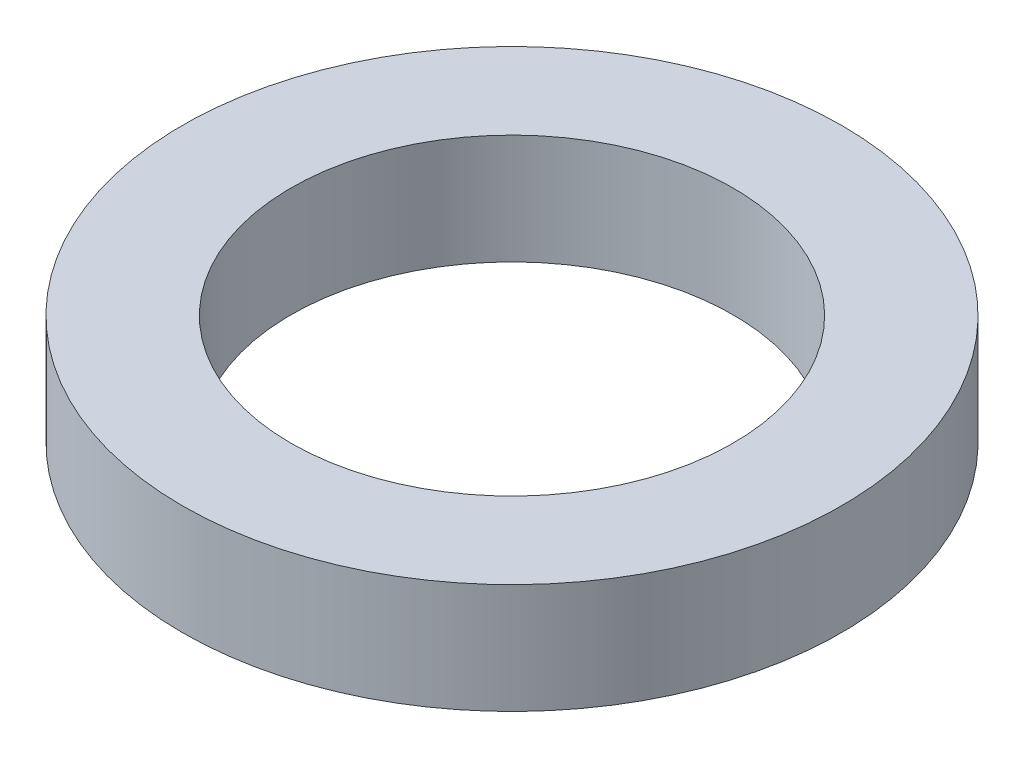
ISO-10303-21;
HEADER;
FILE_DESCRIPTION(('STEP AP214'),'2;1');
FILE_NAME('part.step','',(''),(''),'','','');
FILE_SCHEMA(('AUTOMOTIVE_DESIGN { 1 0 10303 214 1 1 1 1 }'));
ENDSEC;
DATA;
#1=APPLICATION_CONTEXT('core data for automotive mechanical design processes');
#2=APPLICATION_PROTOCOL_DEFINITION('international standard','automotive_design',2000,#1);
#3=PRODUCT_CONTEXT('',#1,'mechanical');
#4=PRODUCT('Part','Part','',(#3));
#5=PRODUCT_RELATED_PRODUCT_CATEGORY('part','',(#4));
#6=PRODUCT_DEFINITION_FORMATION('','',#4);
#7=PRODUCT_DEFINITION_CONTEXT('part definition',#1,'design');
#8=PRODUCT_DEFINITION('design','',#6,#7);
#9=PRODUCT_DEFINITION_SHAPE('','',#8);
#10=(LENGTH_UNIT() NAMED_UNIT(*) SI_UNIT(.MILLI.,.METRE.));
#11=(NAMED_UNIT(*) PLANE_ANGLE_UNIT() SI_UNIT($,.RADIAN.));
#12=(NAMED_UNIT(*) SI_UNIT($,.STERADIAN.) SOLID_ANGLE_UNIT());
#13=UNCERTAINTY_MEASURE_WITH_UNIT(LENGTH_MEASURE(1.E-05),#10,'distance_accuracy_value','');
#14=(GEOMETRIC_REPRESENTATION_CONTEXT(3) GLOBAL_UNCERTAINTY_ASSIGNED_CONTEXT((#13)) GLOBAL_UNIT_ASSIGNED_CONTEXT((#10,
#11,#12)) REPRESENTATION_CONTEXT('',''));
#15=CARTESIAN_POINT('',(0.,0.,0.));
#16=DIRECTION('',(0.,0.,1.));
#17=DIRECTION('',(1.,0.,0.));
#18=AXIS2_PLACEMENT_3D('',#15,#16,#17);
#19=CARTESIAN_POINT('',(0.,2.,0.));
#20=DIRECTION('',(0.,1.,0.));
#21=DIRECTION('',(0.,0.,1.));
#22=AXIS2_PLACEMENT_3D('',#19,#20,#21);
#23=PLANE('',#22);
#24=CARTESIAN_POINT('',(0.,2.,0.));
#25=DIRECTION('',(0.,1.,0.));
#26=DIRECTION('',(0.,0.,1.));
#27=AXIS2_PLACEMENT_3D('',#24,#25,#26);
#28=CIRCLE('',#27,6.);
#29=CARTESIAN_POINT('',(0.,2.,6.));
#30=VERTEX_POINT('',#29);
#31=EDGE_CURVE('E10',#30,#30,#28,.T.);
#32=ORIENTED_EDGE('',*,*,#31,.T.);
#33=EDGE_LOOP('',(#32));
#34=FACE_BOUND('',#33,.T.);
#35=CARTESIAN_POINT('',(0.,2.,0.));
#36=DIRECTION('',(0.,1.,0.));
#37=DIRECTION('',(0.,0.,1.));
#38=AXIS2_PLACEMENT_3D('',#35,#36,#37);
#39=CIRCLE('',#38,4.025);
#40=CARTESIAN_POINT('',(0.,2.,4.025));
#41=VERTEX_POINT('',#40);
#42=EDGE_CURVE('E56',#41,#41,#39,.T.);
#43=ORIENTED_EDGE('',*,*,#42,.F.);
#44=EDGE_LOOP('',(#43));
#45=FACE_BOUND('',#44,.T.);
#46=ADVANCED_FACE('F43',(#34,#45),#23,.T.);
#47=CARTESIAN_POINT('',(0.,0.,0.));
#48=DIRECTION('',(0.,1.,0.));
#49=DIRECTION('',(0.,0.,1.));
#50=AXIS2_PLACEMENT_3D('',#47,#48,#49);
#51=PLANE('',#50);
#52=CARTESIAN_POINT('',(0.,0.,0.));
#53=DIRECTION('',(0.,1.,0.));
#54=DIRECTION('',(0.,0.,1.));
#55=AXIS2_PLACEMENT_3D('',#52,#53,#54);
#56=CIRCLE('',#55,6.);
#57=CARTESIAN_POINT('',(0.,0.,6.));
#58=VERTEX_POINT('',#57);
#59=EDGE_CURVE('E47',#58,#58,#56,.T.);
#60=ORIENTED_EDGE('',*,*,#59,.F.);
#61=EDGE_LOOP('',(#60));
#62=FACE_BOUND('',#61,.T.);
#63=CARTESIAN_POINT('',(0.,0.,0.));
#64=DIRECTION('',(0.,1.,0.));
#65=DIRECTION('',(0.,0.,1.));
#66=AXIS2_PLACEMENT_3D('',#63,#64,#65);
#67=CIRCLE('',#66,4.025);
#68=CARTESIAN_POINT('',(0.,0.,4.025));
#69=VERTEX_POINT('',#68);
#70=EDGE_CURVE('E58',#69,#69,#67,.T.);
#71=ORIENTED_EDGE('',*,*,#70,.T.);
#72=EDGE_LOOP('',(#71));
#73=FACE_BOUND('',#72,.T.);
#74=ADVANCED_FACE('F70',(#62,#73),#51,.F.);
#75=CARTESIAN_POINT('',(0.,2.,0.));
#76=DIRECTION('',(0.,-1.,0.));
#77=DIRECTION('',(0.,0.,-1.));
#78=AXIS2_PLACEMENT_3D('',#75,#76,#77);
#79=CYLINDRICAL_SURFACE('',#78,6.);
#80=ORIENTED_EDGE('',*,*,#31,.F.);
#81=EDGE_LOOP('',(#80));
#82=FACE_BOUND('',#81,.T.);
#83=ORIENTED_EDGE('',*,*,#59,.T.);
#84=EDGE_LOOP('',(#83));
#85=FACE_BOUND('',#84,.T.);
#86=ADVANCED_FACE('F45',(#82,#85),#79,.T.);
#87=CARTESIAN_POINT('',(0.,2.,0.));
#88=DIRECTION('',(0.,-1.,0.));
#89=DIRECTION('',(0.,0.,-1.));
#90=AXIS2_PLACEMENT_3D('',#87,#88,#89);
#91=CYLINDRICAL_SURFACE('',#90,4.025);
#92=ORIENTED_EDGE('',*,*,#42,.T.);
#93=EDGE_LOOP('',(#92));
#94=FACE_BOUND('',#93,.T.);
#95=ORIENTED_EDGE('',*,*,#70,.F.);
#96=EDGE_LOOP('',(#95));
#97=FACE_BOUND('',#96,.T.);
#98=ADVANCED_FACE('F66',(#94,#97),#91,.F.);
#99=CLOSED_SHELL('',(#46,#74,#86,#98));
#100=MANIFOLD_SOLID_BREP('B2',#99);
#101=ADVANCED_BREP_SHAPE_REPRESENTATION('',(#18,#100),#14);
#102=SHAPE_DEFINITION_REPRESENTATION(#9,#101);
ENDSEC;
END-ISO-10303-21;
